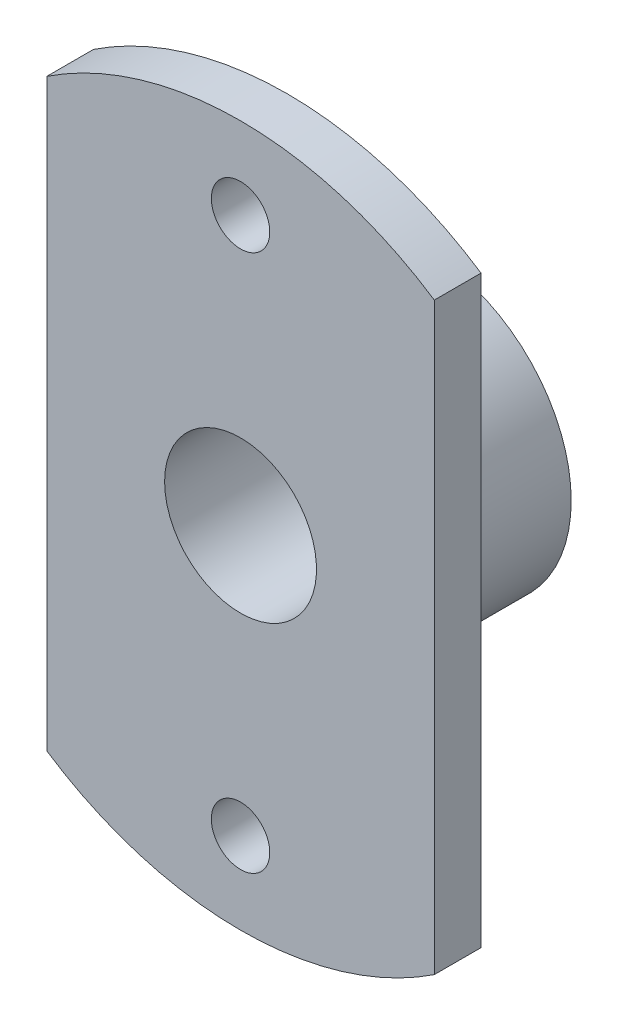
ISO-10303-21;
HEADER;
FILE_DESCRIPTION(('STEP AP214'),'2;1');
FILE_NAME('part.step','',(''),(''),'','','');
FILE_SCHEMA(('AUTOMOTIVE_DESIGN { 1 0 10303 214 1 1 1 1 }'));
ENDSEC;
DATA;
#1=APPLICATION_CONTEXT('core data for automotive mechanical design processes');
#2=APPLICATION_PROTOCOL_DEFINITION('international standard','automotive_design',2000,#1);
#3=PRODUCT_CONTEXT('',#1,'mechanical');
#4=PRODUCT('Part','Part','',(#3));
#5=PRODUCT_RELATED_PRODUCT_CATEGORY('part','',(#4));
#6=PRODUCT_DEFINITION_FORMATION('','',#4);
#7=PRODUCT_DEFINITION_CONTEXT('part definition',#1,'design');
#8=PRODUCT_DEFINITION('design','',#6,#7);
#9=PRODUCT_DEFINITION_SHAPE('','',#8);
#10=(LENGTH_UNIT() NAMED_UNIT(*) SI_UNIT(.MILLI.,.METRE.));
#11=(NAMED_UNIT(*) PLANE_ANGLE_UNIT() SI_UNIT($,.RADIAN.));
#12=(NAMED_UNIT(*) SI_UNIT($,.STERADIAN.) SOLID_ANGLE_UNIT());
#13=UNCERTAINTY_MEASURE_WITH_UNIT(LENGTH_MEASURE(1.E-05),#10,'distance_accuracy_value','');
#14=(GEOMETRIC_REPRESENTATION_CONTEXT(3) GLOBAL_UNCERTAINTY_ASSIGNED_CONTEXT((#13)) GLOBAL_UNIT_ASSIGNED_CONTEXT((#10,
#11,#12)) REPRESENTATION_CONTEXT('',''));
#15=CARTESIAN_POINT('',(0.,0.,0.));
#16=DIRECTION('',(0.,0.,1.));
#17=DIRECTION('',(1.,0.,0.));
#18=AXIS2_PLACEMENT_3D('',#15,#16,#17);
#19=CARTESIAN_POINT('',(0.,0.,16.));
#20=DIRECTION('',(0.,0.,-1.));
#21=DIRECTION('',(-1.,0.,0.));
#22=AXIS2_PLACEMENT_3D('',#19,#20,#21);
#23=CYLINDRICAL_SURFACE('',#22,30.);
#24=CARTESIAN_POINT('',(0.,0.,16.));
#25=DIRECTION('',(0.,0.,1.));
#26=DIRECTION('',(1.,0.,0.));
#27=AXIS2_PLACEMENT_3D('',#24,#25,#26);
#28=CIRCLE('',#27,30.);
#29=CARTESIAN_POINT('',(16.583123951777,25.,16.));
#30=VERTEX_POINT('',#29);
#31=CARTESIAN_POINT('',(-16.583123951777,25.,16.));
#32=VERTEX_POINT('',#31);
#33=EDGE_CURVE('E110',#30,#32,#28,.T.);
#34=ORIENTED_EDGE('',*,*,#33,.F.);
#35=DIRECTION('',(0.,0.,-1.));
#36=VECTOR('',#35,1.);
#37=CARTESIAN_POINT('',(16.583123951777,25.,16.));
#38=LINE('',#37,#36);
#39=CARTESIAN_POINT('',(16.583123951777,25.,12.));
#40=VERTEX_POINT('',#39);
#41=EDGE_CURVE('E87',#30,#40,#38,.T.);
#42=ORIENTED_EDGE('',*,*,#41,.T.);
#43=CARTESIAN_POINT('',(0.,0.,12.));
#44=DIRECTION('',(0.,0.,1.));
#45=DIRECTION('',(1.,0.,0.));
#46=AXIS2_PLACEMENT_3D('',#43,#44,#45);
#47=CIRCLE('',#46,30.);
#48=CARTESIAN_POINT('',(-16.583123951777,25.,12.));
#49=VERTEX_POINT('',#48);
#50=EDGE_CURVE('E111',#40,#49,#47,.T.);
#51=ORIENTED_EDGE('',*,*,#50,.T.);
#52=DIRECTION('',(0.,0.,-1.));
#53=VECTOR('',#52,1.);
#54=CARTESIAN_POINT('',(-16.583123951777,25.,16.));
#55=LINE('',#54,#53);
#56=EDGE_CURVE('E68',#32,#49,#55,.T.);
#57=ORIENTED_EDGE('',*,*,#56,.F.);
#58=EDGE_LOOP('',(#34,#42,#51,#57));
#59=FACE_BOUND('',#58,.T.);
#60=ADVANCED_FACE('F44',(#59),#23,.T.);
#61=CARTESIAN_POINT('',(0.,0.,12.));
#62=DIRECTION('',(0.,0.,-1.));
#63=DIRECTION('',(-1.,0.,0.));
#64=AXIS2_PLACEMENT_3D('',#61,#62,#63);
#65=CYLINDRICAL_SURFACE('',#64,12.3);
#66=CARTESIAN_POINT('',(0.,0.,12.));
#67=DIRECTION('',(0.,0.,1.));
#68=DIRECTION('',(1.,0.,0.));
#69=AXIS2_PLACEMENT_3D('',#66,#67,#68);
#70=CIRCLE('',#69,12.3);
#71=CARTESIAN_POINT('',(12.3,0.,12.));
#72=VERTEX_POINT('',#71);
#73=EDGE_CURVE('E11',#72,#72,#70,.T.);
#74=ORIENTED_EDGE('',*,*,#73,.F.);
#75=EDGE_LOOP('',(#74));
#76=FACE_BOUND('',#75,.T.);
#77=CARTESIAN_POINT('',(0.,0.,0.));
#78=DIRECTION('',(0.,0.,1.));
#79=DIRECTION('',(1.,0.,0.));
#80=AXIS2_PLACEMENT_3D('',#77,#78,#79);
#81=CIRCLE('',#80,12.3);
#82=CARTESIAN_POINT('',(12.3,0.,0.));
#83=VERTEX_POINT('',#82);
#84=EDGE_CURVE('E48',#83,#83,#81,.T.);
#85=ORIENTED_EDGE('',*,*,#84,.T.);
#86=EDGE_LOOP('',(#85));
#87=FACE_BOUND('',#86,.T.);
#88=ADVANCED_FACE('F46',(#76,#87),#65,.T.);
#89=CARTESIAN_POINT('',(0.,0.,0.));
#90=DIRECTION('',(0.,0.,1.));
#91=DIRECTION('',(1.,0.,0.));
#92=AXIS2_PLACEMENT_3D('',#89,#90,#91);
#93=PLANE('',#92);
#94=CARTESIAN_POINT('',(0.,0.,0.));
#95=DIRECTION('',(0.,0.,-1.));
#96=DIRECTION('',(-1.,0.,0.));
#97=AXIS2_PLACEMENT_3D('',#94,#95,#96);
#98=CIRCLE('',#97,6.5);
#99=CARTESIAN_POINT('',(-6.5,0.,0.));
#100=VERTEX_POINT('',#99);
#101=EDGE_CURVE('E135',#100,#100,#98,.T.);
#102=ORIENTED_EDGE('',*,*,#101,.F.);
#103=EDGE_LOOP('',(#102));
#104=FACE_BOUND('',#103,.T.);
#105=ORIENTED_EDGE('',*,*,#84,.F.);
#106=EDGE_LOOP('',(#105));
#107=FACE_BOUND('',#106,.T.);
#108=ADVANCED_FACE('F178',(#104,#107),#93,.F.);
#109=CARTESIAN_POINT('',(-16.583123951777,-25.,12.));
#110=VERTEX_POINT('',#109);
#111=CARTESIAN_POINT('',(16.583123951777,-25.,12.));
#112=VERTEX_POINT('',#111);
#113=EDGE_CURVE('E102',#110,#112,#47,.T.);
#114=ORIENTED_EDGE('',*,*,#113,.T.);
#115=DIRECTION('',(0.,0.,-1.));
#116=VECTOR('',#115,1.);
#117=CARTESIAN_POINT('',(16.583123951777,-25.,16.));
#118=LINE('',#117,#116);
#119=CARTESIAN_POINT('',(16.583123951777,-25.,16.));
#120=VERTEX_POINT('',#119);
#121=EDGE_CURVE('E60',#120,#112,#118,.T.);
#122=ORIENTED_EDGE('',*,*,#121,.F.);
#123=CARTESIAN_POINT('',(-16.583123951777,-25.,16.));
#124=VERTEX_POINT('',#123);
#125=EDGE_CURVE('E100',#124,#120,#28,.T.);
#126=ORIENTED_EDGE('',*,*,#125,.F.);
#127=DIRECTION('',(0.,0.,-1.));
#128=VECTOR('',#127,1.);
#129=CARTESIAN_POINT('',(-16.583123951777,-25.,16.));
#130=LINE('',#129,#128);
#131=EDGE_CURVE('E147',#124,#110,#130,.T.);
#132=ORIENTED_EDGE('',*,*,#131,.T.);
#133=EDGE_LOOP('',(#114,#122,#126,#132));
#134=FACE_BOUND('',#133,.T.);
#135=ADVANCED_FACE('F98',(#134),#23,.T.);
#136=CARTESIAN_POINT('',(0.,0.,16.));
#137=DIRECTION('',(0.,0.,1.));
#138=DIRECTION('',(1.,0.,0.));
#139=AXIS2_PLACEMENT_3D('',#136,#137,#138);
#140=PLANE('',#139);
#141=DIRECTION('',(0.,1.,0.));
#142=VECTOR('',#141,1.);
#143=CARTESIAN_POINT('',(16.583123951777,25.,16.));
#144=LINE('',#143,#142);
#145=EDGE_CURVE('E84',#120,#30,#144,.T.);
#146=ORIENTED_EDGE('',*,*,#145,.T.);
#147=ORIENTED_EDGE('',*,*,#33,.T.);
#148=DIRECTION('',(0.,-1.,0.));
#149=VECTOR('',#148,1.);
#150=CARTESIAN_POINT('',(-16.583123951777,25.,16.));
#151=LINE('',#150,#149);
#152=EDGE_CURVE('E108',#32,#124,#151,.T.);
#153=ORIENTED_EDGE('',*,*,#152,.T.);
#154=ORIENTED_EDGE('',*,*,#125,.T.);
#155=EDGE_LOOP('',(#146,#147,#153,#154));
#156=FACE_BOUND('',#155,.T.);
#157=CARTESIAN_POINT('',(0.,0.,16.));
#158=DIRECTION('',(0.,0.,-1.));
#159=DIRECTION('',(-1.,0.,0.));
#160=AXIS2_PLACEMENT_3D('',#157,#158,#159);
#161=CIRCLE('',#160,6.5);
#162=CARTESIAN_POINT('',(-6.5,0.,16.));
#163=VERTEX_POINT('',#162);
#164=EDGE_CURVE('E123',#163,#163,#161,.T.);
#165=ORIENTED_EDGE('',*,*,#164,.T.);
#166=EDGE_LOOP('',(#165));
#167=FACE_BOUND('',#166,.T.);
#168=CARTESIAN_POINT('',(0.,-23.,16.));
#169=DIRECTION('',(0.,0.,-1.));
#170=DIRECTION('',(-1.,0.,0.));
#171=AXIS2_PLACEMENT_3D('',#168,#169,#170);
#172=CIRCLE('',#171,2.5);
#173=CARTESIAN_POINT('',(-2.5,-23.,16.));
#174=VERTEX_POINT('',#173);
#175=EDGE_CURVE('E131',#174,#174,#172,.T.);
#176=ORIENTED_EDGE('',*,*,#175,.T.);
#177=EDGE_LOOP('',(#176));
#178=FACE_BOUND('',#177,.T.);
#179=CARTESIAN_POINT('',(0.,23.,16.));
#180=DIRECTION('',(0.,0.,-1.));
#181=DIRECTION('',(-1.,0.,0.));
#182=AXIS2_PLACEMENT_3D('',#179,#180,#181);
#183=CIRCLE('',#182,2.5);
#184=CARTESIAN_POINT('',(-2.5,23.,16.));
#185=VERTEX_POINT('',#184);
#186=EDGE_CURVE('E118',#185,#185,#183,.T.);
#187=ORIENTED_EDGE('',*,*,#186,.T.);
#188=EDGE_LOOP('',(#187));
#189=FACE_BOUND('',#188,.T.);
#190=ADVANCED_FACE('F106',(#156,#167,#178,#189),#140,.T.);
#191=CARTESIAN_POINT('',(0.,0.,12.));
#192=DIRECTION('',(0.,0.,1.));
#193=DIRECTION('',(1.,0.,0.));
#194=AXIS2_PLACEMENT_3D('',#191,#192,#193);
#195=PLANE('',#194);
#196=CARTESIAN_POINT('',(0.,-23.,12.));
#197=DIRECTION('',(0.,0.,-1.));
#198=DIRECTION('',(-1.,0.,0.));
#199=AXIS2_PLACEMENT_3D('',#196,#197,#198);
#200=CIRCLE('',#199,2.5);
#201=CARTESIAN_POINT('',(-2.5,-23.,12.));
#202=VERTEX_POINT('',#201);
#203=EDGE_CURVE('E127',#202,#202,#200,.T.);
#204=ORIENTED_EDGE('',*,*,#203,.F.);
#205=EDGE_LOOP('',(#204));
#206=FACE_BOUND('',#205,.T.);
#207=CARTESIAN_POINT('',(0.,23.,12.));
#208=DIRECTION('',(0.,0.,-1.));
#209=DIRECTION('',(-1.,0.,0.));
#210=AXIS2_PLACEMENT_3D('',#207,#208,#209);
#211=CIRCLE('',#210,2.5);
#212=CARTESIAN_POINT('',(-2.5,23.,12.));
#213=VERTEX_POINT('',#212);
#214=EDGE_CURVE('E122',#213,#213,#211,.T.);
#215=ORIENTED_EDGE('',*,*,#214,.F.);
#216=EDGE_LOOP('',(#215));
#217=FACE_BOUND('',#216,.T.);
#218=ORIENTED_EDGE('',*,*,#73,.T.);
#219=EDGE_LOOP('',(#218));
#220=FACE_BOUND('',#219,.T.);
#221=ORIENTED_EDGE('',*,*,#50,.F.);
#222=DIRECTION('',(0.,1.,0.));
#223=VECTOR('',#222,1.);
#224=CARTESIAN_POINT('',(16.583123951777,25.,12.));
#225=LINE('',#224,#223);
#226=EDGE_CURVE('E93',#112,#40,#225,.T.);
#227=ORIENTED_EDGE('',*,*,#226,.F.);
#228=ORIENTED_EDGE('',*,*,#113,.F.);
#229=DIRECTION('',(0.,-1.,0.));
#230=VECTOR('',#229,1.);
#231=CARTESIAN_POINT('',(-16.583123951777,25.,12.));
#232=LINE('',#231,#230);
#233=EDGE_CURVE('E144',#49,#110,#232,.T.);
#234=ORIENTED_EDGE('',*,*,#233,.F.);
#235=EDGE_LOOP('',(#221,#227,#228,#234));
#236=FACE_BOUND('',#235,.T.);
#237=ADVANCED_FACE('F158',(#206,#217,#220,#236),#195,.F.);
#238=CARTESIAN_POINT('',(0.,23.,16.));
#239=DIRECTION('',(0.,0.,-1.));
#240=DIRECTION('',(-1.,0.,0.));
#241=AXIS2_PLACEMENT_3D('',#238,#239,#240);
#242=CYLINDRICAL_SURFACE('',#241,2.5);
#243=ORIENTED_EDGE('',*,*,#186,.F.);
#244=EDGE_LOOP('',(#243));
#245=FACE_BOUND('',#244,.T.);
#246=ORIENTED_EDGE('',*,*,#214,.T.);
#247=EDGE_LOOP('',(#246));
#248=FACE_BOUND('',#247,.T.);
#249=ADVANCED_FACE('F228',(#245,#248),#242,.F.);
#250=CARTESIAN_POINT('',(0.,-23.,16.));
#251=DIRECTION('',(0.,0.,-1.));
#252=DIRECTION('',(-1.,0.,0.));
#253=AXIS2_PLACEMENT_3D('',#250,#251,#252);
#254=CYLINDRICAL_SURFACE('',#253,2.5);
#255=ORIENTED_EDGE('',*,*,#175,.F.);
#256=EDGE_LOOP('',(#255));
#257=FACE_BOUND('',#256,.T.);
#258=ORIENTED_EDGE('',*,*,#203,.T.);
#259=EDGE_LOOP('',(#258));
#260=FACE_BOUND('',#259,.T.);
#261=ADVANCED_FACE('F169',(#257,#260),#254,.F.);
#262=CARTESIAN_POINT('',(0.,0.,16.));
#263=DIRECTION('',(0.,0.,-1.));
#264=DIRECTION('',(-1.,0.,0.));
#265=AXIS2_PLACEMENT_3D('',#262,#263,#264);
#266=CYLINDRICAL_SURFACE('',#265,6.5);
#267=ORIENTED_EDGE('',*,*,#164,.F.);
#268=EDGE_LOOP('',(#267));
#269=FACE_BOUND('',#268,.T.);
#270=ORIENTED_EDGE('',*,*,#101,.T.);
#271=EDGE_LOOP('',(#270));
#272=FACE_BOUND('',#271,.T.);
#273=ADVANCED_FACE('F161',(#269,#272),#266,.F.);
#274=CARTESIAN_POINT('',(-16.583123951777,25.,16.));
#275=DIRECTION('',(1.,0.,0.));
#276=DIRECTION('',(0.,0.,-1.));
#277=AXIS2_PLACEMENT_3D('',#274,#275,#276);
#278=PLANE('',#277);
#279=ORIENTED_EDGE('',*,*,#233,.T.);
#280=ORIENTED_EDGE('',*,*,#131,.F.);
#281=ORIENTED_EDGE('',*,*,#152,.F.);
#282=ORIENTED_EDGE('',*,*,#56,.T.);
#283=EDGE_LOOP('',(#279,#280,#281,#282));
#284=FACE_BOUND('',#283,.T.);
#285=ADVANCED_FACE('F159',(#284),#278,.F.);
#286=CARTESIAN_POINT('',(16.583123951777,25.,16.));
#287=DIRECTION('',(-1.,0.,0.));
#288=DIRECTION('',(0.,0.,1.));
#289=AXIS2_PLACEMENT_3D('',#286,#287,#288);
#290=PLANE('',#289);
#291=ORIENTED_EDGE('',*,*,#226,.T.);
#292=ORIENTED_EDGE('',*,*,#41,.F.);
#293=ORIENTED_EDGE('',*,*,#145,.F.);
#294=ORIENTED_EDGE('',*,*,#121,.T.);
#295=EDGE_LOOP('',(#291,#292,#293,#294));
#296=FACE_BOUND('',#295,.T.);
#297=ADVANCED_FACE('F85',(#296),#290,.F.);
#298=CLOSED_SHELL('',(#60,#88,#108,#135,#190,#237,#249,#261,#273,#285,#297));
#299=MANIFOLD_SOLID_BREP('B2',#298);
#300=ADVANCED_BREP_SHAPE_REPRESENTATION('',(#18,#299),#14);
#301=SHAPE_DEFINITION_REPRESENTATION(#9,#300);
ENDSEC;
END-ISO-10303-21;
